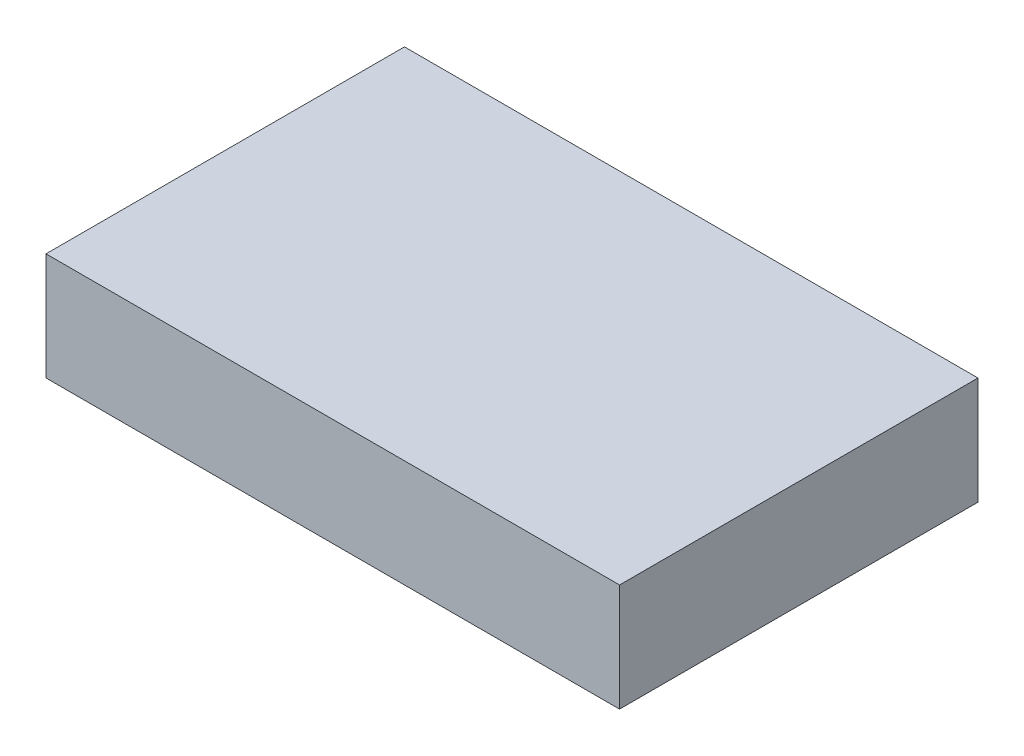
ISO-10303-21;
HEADER;
FILE_DESCRIPTION(('STEP AP214'),'2;1');
FILE_NAME('part.step','',(''),(''),'','','');
FILE_SCHEMA(('AUTOMOTIVE_DESIGN { 1 0 10303 214 1 1 1 1 }'));
ENDSEC;
DATA;
#1=APPLICATION_CONTEXT('core data for automotive mechanical design processes');
#2=APPLICATION_PROTOCOL_DEFINITION('international standard','automotive_design',2000,#1);
#3=PRODUCT_CONTEXT('',#1,'mechanical');
#4=PRODUCT('Part','Part','',(#3));
#5=PRODUCT_RELATED_PRODUCT_CATEGORY('part','',(#4));
#6=PRODUCT_DEFINITION_FORMATION('','',#4);
#7=PRODUCT_DEFINITION_CONTEXT('part definition',#1,'design');
#8=PRODUCT_DEFINITION('design','',#6,#7);
#9=PRODUCT_DEFINITION_SHAPE('','',#8);
#10=(LENGTH_UNIT() NAMED_UNIT(*) SI_UNIT(.MILLI.,.METRE.));
#11=(NAMED_UNIT(*) PLANE_ANGLE_UNIT() SI_UNIT($,.RADIAN.));
#12=(NAMED_UNIT(*) SI_UNIT($,.STERADIAN.) SOLID_ANGLE_UNIT());
#13=UNCERTAINTY_MEASURE_WITH_UNIT(LENGTH_MEASURE(1.E-05),#10,'distance_accuracy_value','');
#14=(GEOMETRIC_REPRESENTATION_CONTEXT(3) GLOBAL_UNCERTAINTY_ASSIGNED_CONTEXT((#13)) GLOBAL_UNIT_ASSIGNED_CONTEXT((#10,
#11,#12)) REPRESENTATION_CONTEXT('',''));
#15=CARTESIAN_POINT('',(0.,0.,0.));
#16=DIRECTION('',(0.,0.,1.));
#17=DIRECTION('',(1.,0.,0.));
#18=AXIS2_PLACEMENT_3D('',#15,#16,#17);
#19=CARTESIAN_POINT('',(-0.3999992,0.07500112,0.));
#20=DIRECTION('',(0.,1.,0.));
#21=DIRECTION('',(0.,0.,1.));
#22=AXIS2_PLACEMENT_3D('',#19,#20,#21);
#23=PLANE('',#22);
#24=DIRECTION('',(0.,0.,-1.));
#25=VECTOR('',#24,1.);
#26=CARTESIAN_POINT('',(0.3999992,0.07500112,0.));
#27=LINE('',#26,#25);
#28=CARTESIAN_POINT('',(0.3999992,0.07500112,0.));
#29=VERTEX_POINT('',#28);
#30=CARTESIAN_POINT('',(0.3999992,0.07500112,0.499999));
#31=VERTEX_POINT('',#30);
#32=EDGE_CURVE('E20',#29,#31,#27,.F.);
#33=ORIENTED_EDGE('',*,*,#32,.F.);
#34=DIRECTION('',(1.,0.,0.));
#35=VECTOR('',#34,1.);
#36=CARTESIAN_POINT('',(0.3999992,0.07500112,0.));
#37=LINE('',#36,#35);
#38=CARTESIAN_POINT('',(-0.3999992,0.07500112,0.));
#39=VERTEX_POINT('',#38);
#40=EDGE_CURVE('E79',#29,#39,#37,.F.);
#41=ORIENTED_EDGE('',*,*,#40,.T.);
#42=DIRECTION('',(0.,0.,1.));
#43=VECTOR('',#42,1.);
#44=CARTESIAN_POINT('',(-0.3999992,0.07500112,0.));
#45=LINE('',#44,#43);
#46=CARTESIAN_POINT('',(-0.3999992,0.07500112,0.499999));
#47=VERTEX_POINT('',#46);
#48=EDGE_CURVE('E61',#47,#39,#45,.F.);
#49=ORIENTED_EDGE('',*,*,#48,.F.);
#50=DIRECTION('',(1.,0.,0.));
#51=VECTOR('',#50,1.);
#52=CARTESIAN_POINT('',(0.3999992,0.07500112,0.499999));
#53=LINE('',#52,#51);
#54=EDGE_CURVE('E56',#31,#47,#53,.F.);
#55=ORIENTED_EDGE('',*,*,#54,.F.);
#56=EDGE_LOOP('',(#33,#41,#49,#55));
#57=FACE_BOUND('',#56,.T.);
#58=ADVANCED_FACE('F17',(#57),#23,.T.);
#59=CARTESIAN_POINT('',(0.3999992,0.07500112,0.));
#60=DIRECTION('',(1.,0.,0.));
#61=DIRECTION('',(0.,0.,-1.));
#62=AXIS2_PLACEMENT_3D('',#59,#60,#61);
#63=PLANE('',#62);
#64=DIRECTION('',(0.,0.,-1.));
#65=VECTOR('',#64,1.);
#66=CARTESIAN_POINT('',(0.3999992,-0.07500112,0.));
#67=LINE('',#66,#65);
#68=CARTESIAN_POINT('',(0.3999992,-0.07500112,0.));
#69=VERTEX_POINT('',#68);
#70=CARTESIAN_POINT('',(0.3999992,-0.07500112,0.499999));
#71=VERTEX_POINT('',#70);
#72=EDGE_CURVE('E83',#69,#71,#67,.F.);
#73=ORIENTED_EDGE('',*,*,#72,.F.);
#74=DIRECTION('',(0.,1.,0.));
#75=VECTOR('',#74,1.);
#76=CARTESIAN_POINT('',(0.3999992,0.07500112,0.));
#77=LINE('',#76,#75);
#78=EDGE_CURVE('E68',#69,#29,#77,.T.);
#79=ORIENTED_EDGE('',*,*,#78,.T.);
#80=ORIENTED_EDGE('',*,*,#32,.T.);
#81=DIRECTION('',(0.,1.,0.));
#82=VECTOR('',#81,1.);
#83=CARTESIAN_POINT('',(0.3999992,0.07500112,0.499999));
#84=LINE('',#83,#82);
#85=EDGE_CURVE('E63',#71,#31,#84,.T.);
#86=ORIENTED_EDGE('',*,*,#85,.F.);
#87=EDGE_LOOP('',(#73,#79,#80,#86));
#88=FACE_BOUND('',#87,.T.);
#89=ADVANCED_FACE('F65',(#88),#63,.T.);
#90=CARTESIAN_POINT('',(0.3999992,0.07500112,0.499999));
#91=DIRECTION('',(0.,0.,1.));
#92=DIRECTION('',(1.,0.,0.));
#93=AXIS2_PLACEMENT_3D('',#90,#91,#92);
#94=PLANE('',#93);
#95=DIRECTION('',(1.,0.,0.));
#96=VECTOR('',#95,1.);
#97=CARTESIAN_POINT('',(0.3999992,-0.07500112,0.499999));
#98=LINE('',#97,#96);
#99=CARTESIAN_POINT('',(-0.3999992,-0.07500112,0.499999));
#100=VERTEX_POINT('',#99);
#101=EDGE_CURVE('E72',#71,#100,#98,.F.);
#102=ORIENTED_EDGE('',*,*,#101,.F.);
#103=ORIENTED_EDGE('',*,*,#85,.T.);
#104=ORIENTED_EDGE('',*,*,#54,.T.);
#105=DIRECTION('',(0.,1.,0.));
#106=VECTOR('',#105,1.);
#107=CARTESIAN_POINT('',(-0.3999992,-0.07500112,0.499999));
#108=LINE('',#107,#106);
#109=EDGE_CURVE('E74',#100,#47,#108,.T.);
#110=ORIENTED_EDGE('',*,*,#109,.F.);
#111=EDGE_LOOP('',(#102,#103,#104,#110));
#112=FACE_BOUND('',#111,.T.);
#113=ADVANCED_FACE('F70',(#112),#94,.T.);
#114=CARTESIAN_POINT('',(-0.3999992,-0.07500112,0.));
#115=DIRECTION('',(-1.,0.,0.));
#116=DIRECTION('',(0.,0.,1.));
#117=AXIS2_PLACEMENT_3D('',#114,#115,#116);
#118=PLANE('',#117);
#119=ORIENTED_EDGE('',*,*,#48,.T.);
#120=DIRECTION('',(0.,1.,0.));
#121=VECTOR('',#120,1.);
#122=CARTESIAN_POINT('',(-0.3999992,0.07500112,0.));
#123=LINE('',#122,#121);
#124=CARTESIAN_POINT('',(-0.3999992,-0.07500112,0.));
#125=VERTEX_POINT('',#124);
#126=EDGE_CURVE('E35',#39,#125,#123,.F.);
#127=ORIENTED_EDGE('',*,*,#126,.T.);
#128=DIRECTION('',(0.,0.,-1.));
#129=VECTOR('',#128,1.);
#130=CARTESIAN_POINT('',(-0.3999992,-0.07500112,0.));
#131=LINE('',#130,#129);
#132=EDGE_CURVE('E26',#100,#125,#131,.T.);
#133=ORIENTED_EDGE('',*,*,#132,.F.);
#134=ORIENTED_EDGE('',*,*,#109,.T.);
#135=EDGE_LOOP('',(#119,#127,#133,#134));
#136=FACE_BOUND('',#135,.T.);
#137=ADVANCED_FACE('F89',(#136),#118,.T.);
#138=CARTESIAN_POINT('',(0.3999992,0.07500112,0.));
#139=DIRECTION('',(0.,0.,1.));
#140=DIRECTION('',(1.,0.,0.));
#141=AXIS2_PLACEMENT_3D('',#138,#139,#140);
#142=PLANE('',#141);
#143=DIRECTION('',(1.,0.,0.));
#144=VECTOR('',#143,1.);
#145=CARTESIAN_POINT('',(0.3999992,-0.07500112,0.));
#146=LINE('',#145,#144);
#147=EDGE_CURVE('E11',#125,#69,#146,.T.);
#148=ORIENTED_EDGE('',*,*,#147,.F.);
#149=ORIENTED_EDGE('',*,*,#126,.F.);
#150=ORIENTED_EDGE('',*,*,#40,.F.);
#151=ORIENTED_EDGE('',*,*,#78,.F.);
#152=EDGE_LOOP('',(#148,#149,#150,#151));
#153=FACE_BOUND('',#152,.T.);
#154=ADVANCED_FACE('F91',(#153),#142,.F.);
#155=CARTESIAN_POINT('',(0.3999992,-0.07500112,0.));
#156=DIRECTION('',(0.,-1.,0.));
#157=DIRECTION('',(0.,0.,-1.));
#158=AXIS2_PLACEMENT_3D('',#155,#156,#157);
#159=PLANE('',#158);
#160=ORIENTED_EDGE('',*,*,#132,.T.);
#161=ORIENTED_EDGE('',*,*,#147,.T.);
#162=ORIENTED_EDGE('',*,*,#72,.T.);
#163=ORIENTED_EDGE('',*,*,#101,.T.);
#164=EDGE_LOOP('',(#160,#161,#162,#163));
#165=FACE_BOUND('',#164,.T.);
#166=ADVANCED_FACE('F88',(#165),#159,.T.);
#167=CLOSED_SHELL('',(#58,#89,#113,#137,#154,#166));
#168=MANIFOLD_SOLID_BREP('B1',#167);
#169=ADVANCED_BREP_SHAPE_REPRESENTATION('',(#18,#168),#14);
#170=SHAPE_DEFINITION_REPRESENTATION(#9,#169);
ENDSEC;
END-ISO-10303-21;
